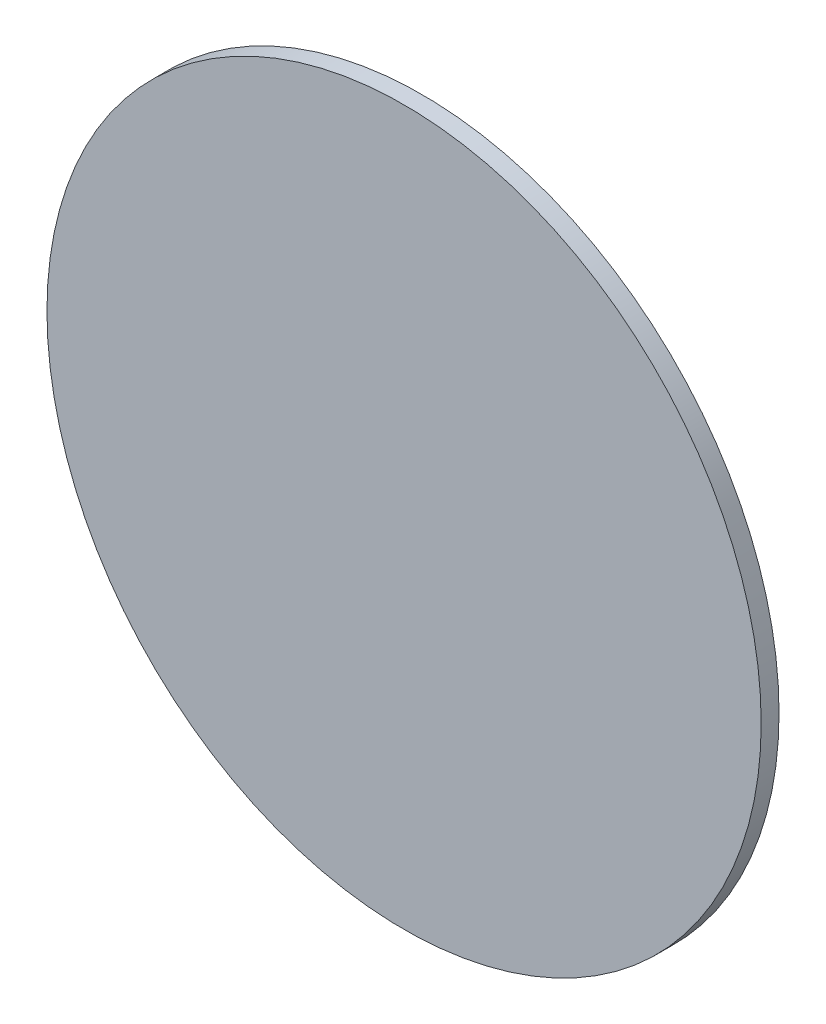
ISO-10303-21;
HEADER;
FILE_DESCRIPTION(('STEP AP214'),'2;1');
FILE_NAME('part.step','',(''),(''),'','','');
FILE_SCHEMA(('AUTOMOTIVE_DESIGN { 1 0 10303 214 1 1 1 1 }'));
ENDSEC;
DATA;
#1=APPLICATION_CONTEXT('core data for automotive mechanical design processes');
#2=APPLICATION_PROTOCOL_DEFINITION('international standard','automotive_design',2000,#1);
#3=PRODUCT_CONTEXT('',#1,'mechanical');
#4=PRODUCT('Part','Part','',(#3));
#5=PRODUCT_RELATED_PRODUCT_CATEGORY('part','',(#4));
#6=PRODUCT_DEFINITION_FORMATION('','',#4);
#7=PRODUCT_DEFINITION_CONTEXT('part definition',#1,'design');
#8=PRODUCT_DEFINITION('design','',#6,#7);
#9=PRODUCT_DEFINITION_SHAPE('','',#8);
#10=(LENGTH_UNIT() NAMED_UNIT(*) SI_UNIT(.MILLI.,.METRE.));
#11=(NAMED_UNIT(*) PLANE_ANGLE_UNIT() SI_UNIT($,.RADIAN.));
#12=(NAMED_UNIT(*) SI_UNIT($,.STERADIAN.) SOLID_ANGLE_UNIT());
#13=UNCERTAINTY_MEASURE_WITH_UNIT(LENGTH_MEASURE(1.E-05),#10,'distance_accuracy_value','');
#14=(GEOMETRIC_REPRESENTATION_CONTEXT(3) GLOBAL_UNCERTAINTY_ASSIGNED_CONTEXT((#13)) GLOBAL_UNIT_ASSIGNED_CONTEXT((#10,
#11,#12)) REPRESENTATION_CONTEXT('',''));
#15=CARTESIAN_POINT('',(0.,0.,0.));
#16=DIRECTION('',(0.,0.,1.));
#17=DIRECTION('',(1.,0.,0.));
#18=AXIS2_PLACEMENT_3D('',#15,#16,#17);
#19=CARTESIAN_POINT('',(0.,0.,0.5));
#20=DIRECTION('',(0.,0.,-1.));
#21=DIRECTION('',(-1.,0.,0.));
#22=AXIS2_PLACEMENT_3D('',#19,#20,#21);
#23=CYLINDRICAL_SURFACE('',#22,10.);
#24=CARTESIAN_POINT('',(0.,0.,0.5));
#25=DIRECTION('',(0.,0.,1.));
#26=DIRECTION('',(1.,0.,0.));
#27=AXIS2_PLACEMENT_3D('',#24,#25,#26);
#28=CIRCLE('',#27,10.);
#29=CARTESIAN_POINT('',(10.,0.,0.5));
#30=VERTEX_POINT('',#29);
#31=EDGE_CURVE('E10',#30,#30,#28,.T.);
#32=ORIENTED_EDGE('',*,*,#31,.F.);
#33=EDGE_LOOP('',(#32));
#34=FACE_BOUND('',#33,.T.);
#35=CARTESIAN_POINT('',(0.,0.,0.));
#36=DIRECTION('',(0.,0.,1.));
#37=DIRECTION('',(1.,0.,0.));
#38=AXIS2_PLACEMENT_3D('',#35,#36,#37);
#39=CIRCLE('',#38,10.);
#40=CARTESIAN_POINT('',(10.,0.,0.));
#41=VERTEX_POINT('',#40);
#42=EDGE_CURVE('E34',#41,#41,#39,.T.);
#43=ORIENTED_EDGE('',*,*,#42,.T.);
#44=EDGE_LOOP('',(#43));
#45=FACE_BOUND('',#44,.T.);
#46=ADVANCED_FACE('F31',(#34,#45),#23,.T.);
#47=CARTESIAN_POINT('',(0.,0.,0.5));
#48=DIRECTION('',(0.,0.,1.));
#49=DIRECTION('',(1.,0.,0.));
#50=AXIS2_PLACEMENT_3D('',#47,#48,#49);
#51=PLANE('',#50);
#52=ORIENTED_EDGE('',*,*,#31,.T.);
#53=EDGE_LOOP('',(#52));
#54=FACE_BOUND('',#53,.T.);
#55=ADVANCED_FACE('F46',(#54),#51,.T.);
#56=CARTESIAN_POINT('',(0.,0.,0.));
#57=DIRECTION('',(0.,0.,1.));
#58=DIRECTION('',(1.,0.,0.));
#59=AXIS2_PLACEMENT_3D('',#56,#57,#58);
#60=PLANE('',#59);
#61=ORIENTED_EDGE('',*,*,#42,.F.);
#62=EDGE_LOOP('',(#61));
#63=FACE_BOUND('',#62,.T.);
#64=ADVANCED_FACE('F44',(#63),#60,.F.);
#65=CLOSED_SHELL('',(#46,#55,#64));
#66=MANIFOLD_SOLID_BREP('B2',#65);
#67=ADVANCED_BREP_SHAPE_REPRESENTATION('',(#18,#66),#14);
#68=SHAPE_DEFINITION_REPRESENTATION(#9,#67);
ENDSEC;
END-ISO-10303-21;
